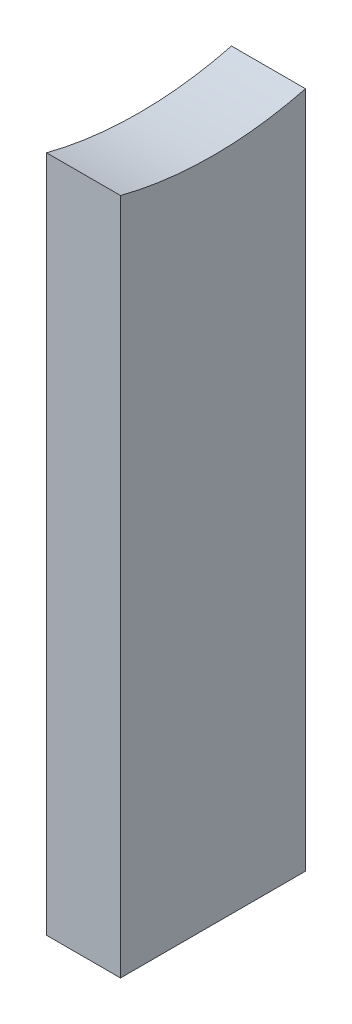
ISO-10303-21;
HEADER;
FILE_DESCRIPTION(('STEP AP214'),'2;1');
FILE_NAME('part.step','',(''),(''),'','','');
FILE_SCHEMA(('AUTOMOTIVE_DESIGN { 1 0 10303 214 1 1 1 1 }'));
ENDSEC;
DATA;
#1=APPLICATION_CONTEXT('core data for automotive mechanical design processes');
#2=APPLICATION_PROTOCOL_DEFINITION('international standard','automotive_design',2000,#1);
#3=PRODUCT_CONTEXT('',#1,'mechanical');
#4=PRODUCT('Part','Part','',(#3));
#5=PRODUCT_RELATED_PRODUCT_CATEGORY('part','',(#4));
#6=PRODUCT_DEFINITION_FORMATION('','',#4);
#7=PRODUCT_DEFINITION_CONTEXT('part definition',#1,'design');
#8=PRODUCT_DEFINITION('design','',#6,#7);
#9=PRODUCT_DEFINITION_SHAPE('','',#8);
#10=(LENGTH_UNIT() NAMED_UNIT(*) SI_UNIT(.MILLI.,.METRE.));
#11=(NAMED_UNIT(*) PLANE_ANGLE_UNIT() SI_UNIT($,.RADIAN.));
#12=(NAMED_UNIT(*) SI_UNIT($,.STERADIAN.) SOLID_ANGLE_UNIT());
#13=UNCERTAINTY_MEASURE_WITH_UNIT(LENGTH_MEASURE(1.E-05),#10,'distance_accuracy_value','');
#14=(GEOMETRIC_REPRESENTATION_CONTEXT(3) GLOBAL_UNCERTAINTY_ASSIGNED_CONTEXT((#13)) GLOBAL_UNIT_ASSIGNED_CONTEXT((#10,
#11,#12)) REPRESENTATION_CONTEXT('',''));
#15=CARTESIAN_POINT('',(0.,0.,0.));
#16=DIRECTION('',(0.,0.,1.));
#17=DIRECTION('',(1.,0.,0.));
#18=AXIS2_PLACEMENT_3D('',#15,#16,#17);
#19=CARTESIAN_POINT('',(5.08,0.,0.));
#20=DIRECTION('',(-1.,0.,0.));
#21=DIRECTION('',(0.,0.,1.));
#22=AXIS2_PLACEMENT_3D('',#19,#20,#21);
#23=CYLINDRICAL_SURFACE('',#22,25.4);
#24=CARTESIAN_POINT('',(0.,0.,0.));
#25=DIRECTION('',(-1.,0.,0.));
#26=DIRECTION('',(0.,0.,-1.));
#27=AXIS2_PLACEMENT_3D('',#24,#25,#26);
#28=CIRCLE('',#27,25.4);
#29=CARTESIAN_POINT('',(0.,-24.5934442484171,-6.35));
#30=VERTEX_POINT('',#29);
#31=CARTESIAN_POINT('',(0.,-24.5934442484171,6.35));
#32=VERTEX_POINT('',#31);
#33=EDGE_CURVE('E95',#30,#32,#28,.T.);
#34=ORIENTED_EDGE('',*,*,#33,.T.);
#35=DIRECTION('',(-1.,0.,0.));
#36=VECTOR('',#35,1.);
#37=CARTESIAN_POINT('',(5.08,-24.5934442484171,6.35));
#38=LINE('',#37,#36);
#39=CARTESIAN_POINT('',(5.08,-24.5934442484171,6.35));
#40=VERTEX_POINT('',#39);
#41=EDGE_CURVE('E11',#40,#32,#38,.T.);
#42=ORIENTED_EDGE('',*,*,#41,.F.);
#43=CARTESIAN_POINT('',(5.08,0.,0.));
#44=DIRECTION('',(-1.,0.,0.));
#45=DIRECTION('',(0.,0.,-1.));
#46=AXIS2_PLACEMENT_3D('',#43,#44,#45);
#47=CIRCLE('',#46,25.4);
#48=CARTESIAN_POINT('',(5.08,-24.5934442484171,-6.35));
#49=VERTEX_POINT('',#48);
#50=EDGE_CURVE('E83',#49,#40,#47,.T.);
#51=ORIENTED_EDGE('',*,*,#50,.F.);
#52=DIRECTION('',(-1.,0.,0.));
#53=VECTOR('',#52,1.);
#54=CARTESIAN_POINT('',(5.08,-24.5934442484171,-6.35));
#55=LINE('',#54,#53);
#56=EDGE_CURVE('E91',#49,#30,#55,.T.);
#57=ORIENTED_EDGE('',*,*,#56,.T.);
#58=EDGE_LOOP('',(#34,#42,#51,#57));
#59=FACE_BOUND('',#58,.T.);
#60=ADVANCED_FACE('F32',(#59),#23,.F.);
#61=CARTESIAN_POINT('',(5.08,-24.5934442484171,6.35));
#62=DIRECTION('',(0.,0.,-1.));
#63=DIRECTION('',(0.,1.,0.));
#64=AXIS2_PLACEMENT_3D('',#61,#62,#63);
#65=PLANE('',#64);
#66=DIRECTION('',(0.,-1.,0.));
#67=VECTOR('',#66,1.);
#68=CARTESIAN_POINT('',(0.,-24.5934442484171,6.35));
#69=LINE('',#68,#67);
#70=CARTESIAN_POINT('',(0.,-71.12,6.35));
#71=VERTEX_POINT('',#70);
#72=EDGE_CURVE('E87',#32,#71,#69,.T.);
#73=ORIENTED_EDGE('',*,*,#72,.T.);
#74=DIRECTION('',(-1.,0.,0.));
#75=VECTOR('',#74,1.);
#76=CARTESIAN_POINT('',(5.08,-71.12,6.35));
#77=LINE('',#76,#75);
#78=CARTESIAN_POINT('',(5.08,-71.12,6.35));
#79=VERTEX_POINT('',#78);
#80=EDGE_CURVE('E40',#79,#71,#77,.T.);
#81=ORIENTED_EDGE('',*,*,#80,.F.);
#82=DIRECTION('',(0.,-1.,0.));
#83=VECTOR('',#82,1.);
#84=CARTESIAN_POINT('',(5.08,-24.5934442484171,6.35));
#85=LINE('',#84,#83);
#86=EDGE_CURVE('E78',#40,#79,#85,.T.);
#87=ORIENTED_EDGE('',*,*,#86,.F.);
#88=ORIENTED_EDGE('',*,*,#41,.T.);
#89=EDGE_LOOP('',(#73,#81,#87,#88));
#90=FACE_BOUND('',#89,.T.);
#91=ADVANCED_FACE('F86',(#90),#65,.F.);
#92=CARTESIAN_POINT('',(5.08,-71.12,6.35));
#93=DIRECTION('',(0.,1.,0.));
#94=DIRECTION('',(0.,0.,1.));
#95=AXIS2_PLACEMENT_3D('',#92,#93,#94);
#96=PLANE('',#95);
#97=DIRECTION('',(0.,0.,-1.));
#98=VECTOR('',#97,1.);
#99=CARTESIAN_POINT('',(0.,-71.12,6.35));
#100=LINE('',#99,#98);
#101=CARTESIAN_POINT('',(0.,-71.12,-6.35));
#102=VERTEX_POINT('',#101);
#103=EDGE_CURVE('E65',#71,#102,#100,.T.);
#104=ORIENTED_EDGE('',*,*,#103,.T.);
#105=DIRECTION('',(-1.,0.,0.));
#106=VECTOR('',#105,1.);
#107=CARTESIAN_POINT('',(5.08,-71.12,-6.35));
#108=LINE('',#107,#106);
#109=CARTESIAN_POINT('',(5.08,-71.12,-6.35));
#110=VERTEX_POINT('',#109);
#111=EDGE_CURVE('E88',#110,#102,#108,.T.);
#112=ORIENTED_EDGE('',*,*,#111,.F.);
#113=DIRECTION('',(0.,0.,-1.));
#114=VECTOR('',#113,1.);
#115=CARTESIAN_POINT('',(5.08,-71.12,6.35));
#116=LINE('',#115,#114);
#117=EDGE_CURVE('E81',#79,#110,#116,.T.);
#118=ORIENTED_EDGE('',*,*,#117,.F.);
#119=ORIENTED_EDGE('',*,*,#80,.T.);
#120=EDGE_LOOP('',(#104,#112,#118,#119));
#121=FACE_BOUND('',#120,.T.);
#122=ADVANCED_FACE('F89',(#121),#96,.F.);
#123=CARTESIAN_POINT('',(5.08,-71.12,-6.35));
#124=DIRECTION('',(0.,0.,1.));
#125=DIRECTION('',(0.,-1.,0.));
#126=AXIS2_PLACEMENT_3D('',#123,#124,#125);
#127=PLANE('',#126);
#128=DIRECTION('',(0.,1.,0.));
#129=VECTOR('',#128,1.);
#130=CARTESIAN_POINT('',(0.,-71.12,-6.35));
#131=LINE('',#130,#129);
#132=EDGE_CURVE('E71',#102,#30,#131,.T.);
#133=ORIENTED_EDGE('',*,*,#132,.T.);
#134=ORIENTED_EDGE('',*,*,#56,.F.);
#135=DIRECTION('',(0.,1.,0.));
#136=VECTOR('',#135,1.);
#137=CARTESIAN_POINT('',(5.08,-71.12,-6.35));
#138=LINE('',#137,#136);
#139=EDGE_CURVE('E48',#110,#49,#138,.T.);
#140=ORIENTED_EDGE('',*,*,#139,.F.);
#141=ORIENTED_EDGE('',*,*,#111,.T.);
#142=EDGE_LOOP('',(#133,#134,#140,#141));
#143=FACE_BOUND('',#142,.T.);
#144=ADVANCED_FACE('F102',(#143),#127,.F.);
#145=CARTESIAN_POINT('',(5.08,0.,0.));
#146=DIRECTION('',(1.,0.,0.));
#147=DIRECTION('',(0.,0.,-1.));
#148=AXIS2_PLACEMENT_3D('',#145,#146,#147);
#149=PLANE('',#148);
#150=ORIENTED_EDGE('',*,*,#50,.T.);
#151=ORIENTED_EDGE('',*,*,#86,.T.);
#152=ORIENTED_EDGE('',*,*,#117,.T.);
#153=ORIENTED_EDGE('',*,*,#139,.T.);
#154=EDGE_LOOP('',(#150,#151,#152,#153));
#155=FACE_BOUND('',#154,.T.);
#156=ADVANCED_FACE('F79',(#155),#149,.T.);
#157=CARTESIAN_POINT('',(0.,0.,0.));
#158=DIRECTION('',(1.,0.,0.));
#159=DIRECTION('',(0.,0.,-1.));
#160=AXIS2_PLACEMENT_3D('',#157,#158,#159);
#161=PLANE('',#160);
#162=ORIENTED_EDGE('',*,*,#33,.F.);
#163=ORIENTED_EDGE('',*,*,#132,.F.);
#164=ORIENTED_EDGE('',*,*,#103,.F.);
#165=ORIENTED_EDGE('',*,*,#72,.F.);
#166=EDGE_LOOP('',(#162,#163,#164,#165));
#167=FACE_BOUND('',#166,.T.);
#168=ADVANCED_FACE('F105',(#167),#161,.F.);
#169=CLOSED_SHELL('',(#60,#91,#122,#144,#156,#168));
#170=MANIFOLD_SOLID_BREP('B2',#169);
#171=ADVANCED_BREP_SHAPE_REPRESENTATION('',(#18,#170),#14);
#172=SHAPE_DEFINITION_REPRESENTATION(#9,#171);
ENDSEC;
END-ISO-10303-21;
